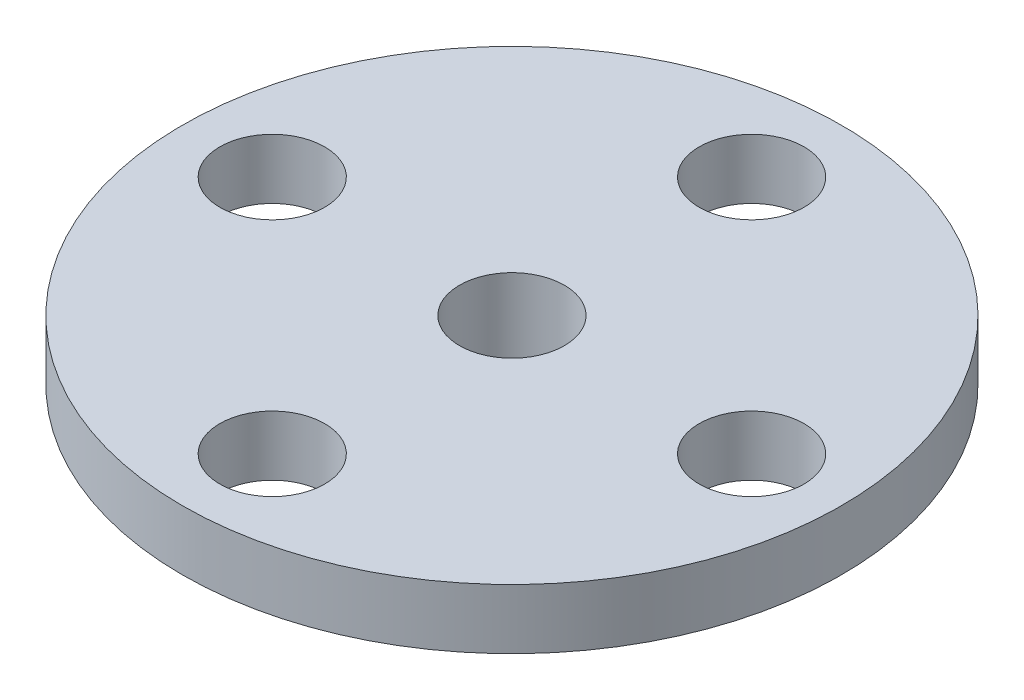
ISO-10303-21;
HEADER;
FILE_DESCRIPTION(('STEP AP214'),'2;1');
FILE_NAME('part.step','',(''),(''),'','','');
FILE_SCHEMA(('AUTOMOTIVE_DESIGN { 1 0 10303 214 1 1 1 1 }'));
ENDSEC;
DATA;
#1=APPLICATION_CONTEXT('core data for automotive mechanical design processes');
#2=APPLICATION_PROTOCOL_DEFINITION('international standard','automotive_design',2000,#1);
#3=PRODUCT_CONTEXT('',#1,'mechanical');
#4=PRODUCT('Part','Part','',(#3));
#5=PRODUCT_RELATED_PRODUCT_CATEGORY('part','',(#4));
#6=PRODUCT_DEFINITION_FORMATION('','',#4);
#7=PRODUCT_DEFINITION_CONTEXT('part definition',#1,'design');
#8=PRODUCT_DEFINITION('design','',#6,#7);
#9=PRODUCT_DEFINITION_SHAPE('','',#8);
#10=(LENGTH_UNIT() NAMED_UNIT(*) SI_UNIT(.MILLI.,.METRE.));
#11=(NAMED_UNIT(*) PLANE_ANGLE_UNIT() SI_UNIT($,.RADIAN.));
#12=(NAMED_UNIT(*) SI_UNIT($,.STERADIAN.) SOLID_ANGLE_UNIT());
#13=UNCERTAINTY_MEASURE_WITH_UNIT(LENGTH_MEASURE(1.E-05),#10,'distance_accuracy_value','');
#14=(GEOMETRIC_REPRESENTATION_CONTEXT(3) GLOBAL_UNCERTAINTY_ASSIGNED_CONTEXT((#13)) GLOBAL_UNIT_ASSIGNED_CONTEXT((#10,
#11,#12)) REPRESENTATION_CONTEXT('',''));
#15=CARTESIAN_POINT('',(0.,0.,0.));
#16=DIRECTION('',(0.,0.,1.));
#17=DIRECTION('',(1.,0.,0.));
#18=AXIS2_PLACEMENT_3D('',#15,#16,#17);
#19=CARTESIAN_POINT('',(11.,0.,0.));
#20=DIRECTION('',(0.,-1.,0.));
#21=DIRECTION('',(0.,0.,-1.));
#22=AXIS2_PLACEMENT_3D('',#19,#20,#21);
#23=PLANE('',#22);
#24=CARTESIAN_POINT('',(8.,0.,0.));
#25=DIRECTION('',(0.,-1.,0.));
#26=DIRECTION('',(0.,0.,-1.));
#27=AXIS2_PLACEMENT_3D('',#24,#25,#26);
#28=CIRCLE('',#27,1.74999999999999);
#29=CARTESIAN_POINT('',(8.,0.,-1.74999999999999));
#30=VERTEX_POINT('',#29);
#31=EDGE_CURVE('E74',#30,#30,#28,.T.);
#32=ORIENTED_EDGE('',*,*,#31,.F.);
#33=EDGE_LOOP('',(#32));
#34=FACE_BOUND('',#33,.T.);
#35=CARTESIAN_POINT('',(0.,0.,8.));
#36=DIRECTION('',(0.,-1.,0.));
#37=DIRECTION('',(0.,0.,-1.));
#38=AXIS2_PLACEMENT_3D('',#35,#36,#37);
#39=CIRCLE('',#38,1.74999999999999);
#40=CARTESIAN_POINT('',(0.,0.,6.25000000000001));
#41=VERTEX_POINT('',#40);
#42=EDGE_CURVE('E68',#41,#41,#39,.T.);
#43=ORIENTED_EDGE('',*,*,#42,.F.);
#44=EDGE_LOOP('',(#43));
#45=FACE_BOUND('',#44,.T.);
#46=CARTESIAN_POINT('',(-8.,0.,0.));
#47=DIRECTION('',(0.,-1.,0.));
#48=DIRECTION('',(0.,0.,-1.));
#49=AXIS2_PLACEMENT_3D('',#46,#47,#48);
#50=CIRCLE('',#49,1.74999999999999);
#51=CARTESIAN_POINT('',(-8.,0.,-1.74999999999999));
#52=VERTEX_POINT('',#51);
#53=EDGE_CURVE('E62',#52,#52,#50,.T.);
#54=ORIENTED_EDGE('',*,*,#53,.F.);
#55=EDGE_LOOP('',(#54));
#56=FACE_BOUND('',#55,.T.);
#57=CARTESIAN_POINT('',(0.,0.,-8.));
#58=DIRECTION('',(0.,-1.,0.));
#59=DIRECTION('',(0.,0.,-1.));
#60=AXIS2_PLACEMENT_3D('',#57,#58,#59);
#61=CIRCLE('',#60,1.74999999999999);
#62=CARTESIAN_POINT('',(0.,0.,-9.74999999999999));
#63=VERTEX_POINT('',#62);
#64=EDGE_CURVE('E56',#63,#63,#61,.T.);
#65=ORIENTED_EDGE('',*,*,#64,.F.);
#66=EDGE_LOOP('',(#65));
#67=FACE_BOUND('',#66,.T.);
#68=CARTESIAN_POINT('',(0.,0.,0.));
#69=DIRECTION('',(0.,1.,0.));
#70=DIRECTION('',(0.,0.,1.));
#71=AXIS2_PLACEMENT_3D('',#68,#69,#70);
#72=CIRCLE('',#71,11.);
#73=CARTESIAN_POINT('',(0.,0.,11.));
#74=VERTEX_POINT('',#73);
#75=EDGE_CURVE('E10',#74,#74,#72,.T.);
#76=ORIENTED_EDGE('',*,*,#75,.F.);
#77=EDGE_LOOP('',(#76));
#78=FACE_BOUND('',#77,.T.);
#79=CARTESIAN_POINT('',(0.,0.,0.));
#80=DIRECTION('',(0.,-1.,0.));
#81=DIRECTION('',(0.,0.,-1.));
#82=AXIS2_PLACEMENT_3D('',#79,#80,#81);
#83=CIRCLE('',#82,4.4);
#84=CARTESIAN_POINT('',(0.,0.,-4.4));
#85=VERTEX_POINT('',#84);
#86=EDGE_CURVE('E48',#85,#85,#83,.T.);
#87=ORIENTED_EDGE('',*,*,#86,.F.);
#88=EDGE_LOOP('',(#87));
#89=FACE_BOUND('',#88,.T.);
#90=ADVANCED_FACE('F33',(#34,#45,#56,#67,#78,#89),#23,.T.);
#91=CARTESIAN_POINT('',(0.,0.,0.));
#92=DIRECTION('',(0.,1.,0.));
#93=DIRECTION('',(0.,0.,1.));
#94=AXIS2_PLACEMENT_3D('',#91,#92,#93);
#95=CYLINDRICAL_SURFACE('',#94,11.);
#96=ORIENTED_EDGE('',*,*,#75,.T.);
#97=EDGE_LOOP('',(#96));
#98=FACE_BOUND('',#97,.T.);
#99=CARTESIAN_POINT('',(0.,2.,0.));
#100=DIRECTION('',(0.,1.,0.));
#101=DIRECTION('',(0.,0.,1.));
#102=AXIS2_PLACEMENT_3D('',#99,#100,#101);
#103=CIRCLE('',#102,11.);
#104=CARTESIAN_POINT('',(0.,2.,11.));
#105=VERTEX_POINT('',#104);
#106=EDGE_CURVE('E40',#105,#105,#103,.T.);
#107=ORIENTED_EDGE('',*,*,#106,.F.);
#108=EDGE_LOOP('',(#107));
#109=FACE_BOUND('',#108,.T.);
#110=ADVANCED_FACE('F35',(#98,#109),#95,.T.);
#111=CARTESIAN_POINT('',(0.,2.,0.));
#112=DIRECTION('',(0.,1.,0.));
#113=DIRECTION('',(0.,0.,1.));
#114=AXIS2_PLACEMENT_3D('',#111,#112,#113);
#115=PLANE('',#114);
#116=CARTESIAN_POINT('',(0.,2.,0.));
#117=DIRECTION('',(0.,-1.,0.));
#118=DIRECTION('',(0.,0.,-1.));
#119=AXIS2_PLACEMENT_3D('',#116,#117,#118);
#120=CIRCLE('',#119,1.75000000000001);
#121=CARTESIAN_POINT('',(0.,2.,-1.75000000000001));
#122=VERTEX_POINT('',#121);
#123=EDGE_CURVE('E77',#122,#122,#120,.T.);
#124=ORIENTED_EDGE('',*,*,#123,.T.);
#125=EDGE_LOOP('',(#124));
#126=FACE_BOUND('',#125,.T.);
#127=CARTESIAN_POINT('',(8.,2.,0.));
#128=DIRECTION('',(0.,-1.,0.));
#129=DIRECTION('',(0.,0.,-1.));
#130=AXIS2_PLACEMENT_3D('',#127,#128,#129);
#131=CIRCLE('',#130,1.74999999999999);
#132=CARTESIAN_POINT('',(8.,2.,-1.74999999999999));
#133=VERTEX_POINT('',#132);
#134=EDGE_CURVE('E71',#133,#133,#131,.T.);
#135=ORIENTED_EDGE('',*,*,#134,.T.);
#136=EDGE_LOOP('',(#135));
#137=FACE_BOUND('',#136,.T.);
#138=CARTESIAN_POINT('',(0.,2.,8.));
#139=DIRECTION('',(0.,-1.,0.));
#140=DIRECTION('',(0.,0.,-1.));
#141=AXIS2_PLACEMENT_3D('',#138,#139,#140);
#142=CIRCLE('',#141,1.74999999999999);
#143=CARTESIAN_POINT('',(0.,2.,6.25000000000001));
#144=VERTEX_POINT('',#143);
#145=EDGE_CURVE('E65',#144,#144,#142,.T.);
#146=ORIENTED_EDGE('',*,*,#145,.T.);
#147=EDGE_LOOP('',(#146));
#148=FACE_BOUND('',#147,.T.);
#149=CARTESIAN_POINT('',(-8.,2.,0.));
#150=DIRECTION('',(0.,-1.,0.));
#151=DIRECTION('',(0.,0.,-1.));
#152=AXIS2_PLACEMENT_3D('',#149,#150,#151);
#153=CIRCLE('',#152,1.74999999999999);
#154=CARTESIAN_POINT('',(-8.,2.,-1.74999999999999));
#155=VERTEX_POINT('',#154);
#156=EDGE_CURVE('E59',#155,#155,#153,.T.);
#157=ORIENTED_EDGE('',*,*,#156,.T.);
#158=EDGE_LOOP('',(#157));
#159=FACE_BOUND('',#158,.T.);
#160=CARTESIAN_POINT('',(0.,2.,-8.));
#161=DIRECTION('',(0.,-1.,0.));
#162=DIRECTION('',(0.,0.,-1.));
#163=AXIS2_PLACEMENT_3D('',#160,#161,#162);
#164=CIRCLE('',#163,1.74999999999999);
#165=CARTESIAN_POINT('',(0.,2.,-9.74999999999999));
#166=VERTEX_POINT('',#165);
#167=EDGE_CURVE('E52',#166,#166,#164,.T.);
#168=ORIENTED_EDGE('',*,*,#167,.T.);
#169=EDGE_LOOP('',(#168));
#170=FACE_BOUND('',#169,.T.);
#171=ORIENTED_EDGE('',*,*,#106,.T.);
#172=EDGE_LOOP('',(#171));
#173=FACE_BOUND('',#172,.T.);
#174=ADVANCED_FACE('F102',(#126,#137,#148,#159,#170,#173),#115,.T.);
#175=CARTESIAN_POINT('',(0.,-4.2,0.));
#176=DIRECTION('',(0.,1.,0.));
#177=DIRECTION('',(0.,0.,1.));
#178=AXIS2_PLACEMENT_3D('',#175,#176,#177);
#179=CYLINDRICAL_SURFACE('',#178,4.4);
#180=CARTESIAN_POINT('',(0.,-4.2,0.));
#181=DIRECTION('',(0.,-1.,0.));
#182=DIRECTION('',(0.,0.,-1.));
#183=AXIS2_PLACEMENT_3D('',#180,#181,#182);
#184=CIRCLE('',#183,4.4);
#185=CARTESIAN_POINT('',(0.,-4.2,-4.4));
#186=VERTEX_POINT('',#185);
#187=EDGE_CURVE('E44',#186,#186,#184,.T.);
#188=ORIENTED_EDGE('',*,*,#187,.F.);
#189=EDGE_LOOP('',(#188));
#190=FACE_BOUND('',#189,.T.);
#191=ORIENTED_EDGE('',*,*,#86,.T.);
#192=EDGE_LOOP('',(#191));
#193=FACE_BOUND('',#192,.T.);
#194=ADVANCED_FACE('F96',(#190,#193),#179,.T.);
#195=CARTESIAN_POINT('',(0.,-4.2,0.));
#196=DIRECTION('',(0.,-1.,0.));
#197=DIRECTION('',(0.,0.,-1.));
#198=AXIS2_PLACEMENT_3D('',#195,#196,#197);
#199=PLANE('',#198);
#200=CARTESIAN_POINT('',(0.,-4.2,0.));
#201=DIRECTION('',(0.,-1.,0.));
#202=DIRECTION('',(0.,0.,-1.));
#203=AXIS2_PLACEMENT_3D('',#200,#201,#202);
#204=CIRCLE('',#203,2.84999999999999);
#205=CARTESIAN_POINT('',(0.,-4.2,-2.84999999999999));
#206=VERTEX_POINT('',#205);
#207=EDGE_CURVE('E86',#206,#206,#204,.T.);
#208=ORIENTED_EDGE('',*,*,#207,.F.);
#209=EDGE_LOOP('',(#208));
#210=FACE_BOUND('',#209,.T.);
#211=ORIENTED_EDGE('',*,*,#187,.T.);
#212=EDGE_LOOP('',(#211));
#213=FACE_BOUND('',#212,.T.);
#214=ADVANCED_FACE('F92',(#210,#213),#199,.T.);
#215=CARTESIAN_POINT('',(0.,0.,-8.));
#216=DIRECTION('',(0.,-1.,0.));
#217=DIRECTION('',(0.,0.,-1.));
#218=AXIS2_PLACEMENT_3D('',#215,#216,#217);
#219=CYLINDRICAL_SURFACE('',#218,1.74999999999999);
#220=ORIENTED_EDGE('',*,*,#167,.F.);
#221=EDGE_LOOP('',(#220));
#222=FACE_BOUND('',#221,.T.);
#223=ORIENTED_EDGE('',*,*,#64,.T.);
#224=EDGE_LOOP('',(#223));
#225=FACE_BOUND('',#224,.T.);
#226=ADVANCED_FACE('F95',(#222,#225),#219,.F.);
#227=CARTESIAN_POINT('',(-8.,0.,0.));
#228=DIRECTION('',(0.,-1.,0.));
#229=DIRECTION('',(0.,0.,-1.));
#230=AXIS2_PLACEMENT_3D('',#227,#228,#229);
#231=CYLINDRICAL_SURFACE('',#230,1.74999999999999);
#232=ORIENTED_EDGE('',*,*,#156,.F.);
#233=EDGE_LOOP('',(#232));
#234=FACE_BOUND('',#233,.T.);
#235=ORIENTED_EDGE('',*,*,#53,.T.);
#236=EDGE_LOOP('',(#235));
#237=FACE_BOUND('',#236,.T.);
#238=ADVANCED_FACE('F119',(#234,#237),#231,.F.);
#239=CARTESIAN_POINT('',(0.,0.,8.));
#240=DIRECTION('',(0.,-1.,0.));
#241=DIRECTION('',(0.,0.,-1.));
#242=AXIS2_PLACEMENT_3D('',#239,#240,#241);
#243=CYLINDRICAL_SURFACE('',#242,1.74999999999999);
#244=ORIENTED_EDGE('',*,*,#145,.F.);
#245=EDGE_LOOP('',(#244));
#246=FACE_BOUND('',#245,.T.);
#247=ORIENTED_EDGE('',*,*,#42,.T.);
#248=EDGE_LOOP('',(#247));
#249=FACE_BOUND('',#248,.T.);
#250=ADVANCED_FACE('F123',(#246,#249),#243,.F.);
#251=CARTESIAN_POINT('',(8.,0.,0.));
#252=DIRECTION('',(0.,-1.,0.));
#253=DIRECTION('',(0.,0.,-1.));
#254=AXIS2_PLACEMENT_3D('',#251,#252,#253);
#255=CYLINDRICAL_SURFACE('',#254,1.74999999999999);
#256=ORIENTED_EDGE('',*,*,#134,.F.);
#257=EDGE_LOOP('',(#256));
#258=FACE_BOUND('',#257,.T.);
#259=ORIENTED_EDGE('',*,*,#31,.T.);
#260=EDGE_LOOP('',(#259));
#261=FACE_BOUND('',#260,.T.);
#262=ADVANCED_FACE('F127',(#258,#261),#255,.F.);
#263=CARTESIAN_POINT('',(0.,-4.2,0.));
#264=DIRECTION('',(0.,-1.,0.));
#265=DIRECTION('',(0.,0.,-1.));
#266=AXIS2_PLACEMENT_3D('',#263,#264,#265);
#267=CYLINDRICAL_SURFACE('',#266,1.75000000000001);
#268=ORIENTED_EDGE('',*,*,#123,.F.);
#269=EDGE_LOOP('',(#268));
#270=FACE_BOUND('',#269,.T.);
#271=CARTESIAN_POINT('',(0.,-1.2,0.));
#272=DIRECTION('',(0.,-1.,0.));
#273=DIRECTION('',(0.,0.,-1.));
#274=AXIS2_PLACEMENT_3D('',#271,#272,#273);
#275=CIRCLE('',#274,1.75000000000001);
#276=CARTESIAN_POINT('',(0.,-1.2,-1.75000000000001));
#277=VERTEX_POINT('',#276);
#278=EDGE_CURVE('E80',#277,#277,#275,.T.);
#279=ORIENTED_EDGE('',*,*,#278,.T.);
#280=EDGE_LOOP('',(#279));
#281=FACE_BOUND('',#280,.T.);
#282=ADVANCED_FACE('F131',(#270,#281),#267,.F.);
#283=CARTESIAN_POINT('',(1.75000000000001,-1.2,0.));
#284=DIRECTION('',(0.,1.,0.));
#285=DIRECTION('',(0.,0.,1.));
#286=AXIS2_PLACEMENT_3D('',#283,#284,#285);
#287=PLANE('',#286);
#288=ORIENTED_EDGE('',*,*,#278,.F.);
#289=EDGE_LOOP('',(#288));
#290=FACE_BOUND('',#289,.T.);
#291=CARTESIAN_POINT('',(0.,-1.2,0.));
#292=DIRECTION('',(0.,-1.,0.));
#293=DIRECTION('',(0.,0.,-1.));
#294=AXIS2_PLACEMENT_3D('',#291,#292,#293);
#295=CIRCLE('',#294,2.84999999999999);
#296=CARTESIAN_POINT('',(0.,-1.2,-2.84999999999999));
#297=VERTEX_POINT('',#296);
#298=EDGE_CURVE('E83',#297,#297,#295,.T.);
#299=ORIENTED_EDGE('',*,*,#298,.T.);
#300=EDGE_LOOP('',(#299));
#301=FACE_BOUND('',#300,.T.);
#302=ADVANCED_FACE('F135',(#290,#301),#287,.F.);
#303=CARTESIAN_POINT('',(0.,-4.2,0.));
#304=DIRECTION('',(0.,-1.,0.));
#305=DIRECTION('',(0.,0.,-1.));
#306=AXIS2_PLACEMENT_3D('',#303,#304,#305);
#307=CYLINDRICAL_SURFACE('',#306,2.84999999999999);
#308=ORIENTED_EDGE('',*,*,#298,.F.);
#309=EDGE_LOOP('',(#308));
#310=FACE_BOUND('',#309,.T.);
#311=ORIENTED_EDGE('',*,*,#207,.T.);
#312=EDGE_LOOP('',(#311));
#313=FACE_BOUND('',#312,.T.);
#314=ADVANCED_FACE('F90',(#310,#313),#307,.F.);
#315=CLOSED_SHELL('',(#90,#110,#174,#194,#214,#226,#238,#250,#262,#282,#302,#314));
#316=MANIFOLD_SOLID_BREP('B2',#315);
#317=ADVANCED_BREP_SHAPE_REPRESENTATION('',(#18,#316),#14);
#318=SHAPE_DEFINITION_REPRESENTATION(#9,#317);
ENDSEC;
END-ISO-10303-21;
